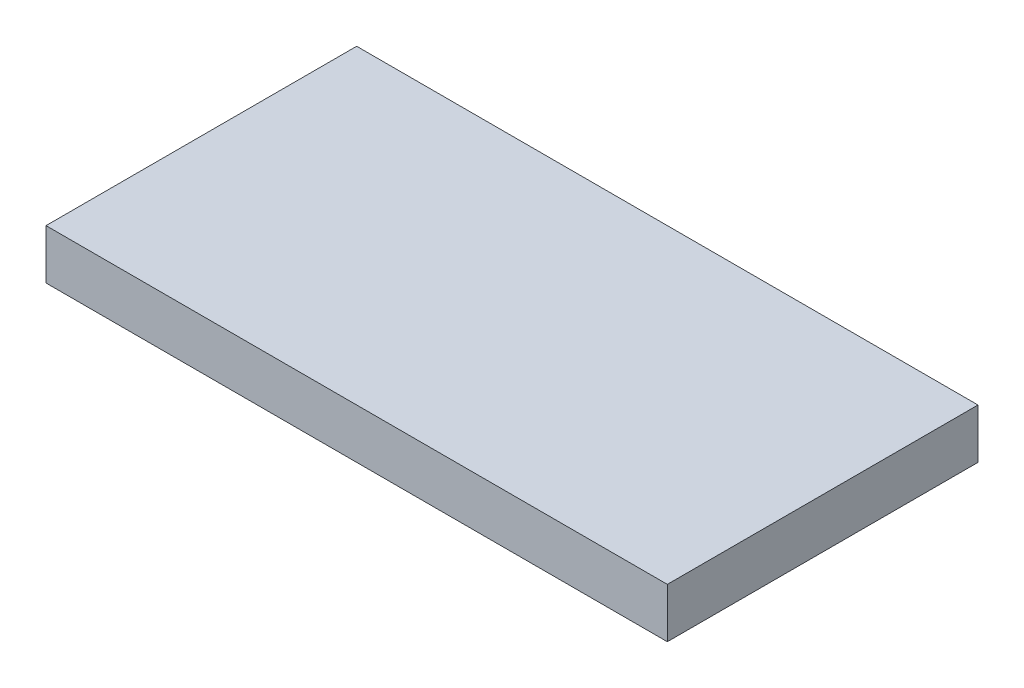
ISO-10303-21;
HEADER;
FILE_DESCRIPTION(('STEP AP214'),'2;1');
FILE_NAME('part.step','',(''),(''),'','','');
FILE_SCHEMA(('AUTOMOTIVE_DESIGN { 1 0 10303 214 1 1 1 1 }'));
ENDSEC;
DATA;
#1=APPLICATION_CONTEXT('core data for automotive mechanical design processes');
#2=APPLICATION_PROTOCOL_DEFINITION('international standard','automotive_design',2000,#1);
#3=PRODUCT_CONTEXT('',#1,'mechanical');
#4=PRODUCT('Part','Part','',(#3));
#5=PRODUCT_RELATED_PRODUCT_CATEGORY('part','',(#4));
#6=PRODUCT_DEFINITION_FORMATION('','',#4);
#7=PRODUCT_DEFINITION_CONTEXT('part definition',#1,'design');
#8=PRODUCT_DEFINITION('design','',#6,#7);
#9=PRODUCT_DEFINITION_SHAPE('','',#8);
#10=(LENGTH_UNIT() NAMED_UNIT(*) SI_UNIT(.MILLI.,.METRE.));
#11=(NAMED_UNIT(*) PLANE_ANGLE_UNIT() SI_UNIT($,.RADIAN.));
#12=(NAMED_UNIT(*) SI_UNIT($,.STERADIAN.) SOLID_ANGLE_UNIT());
#13=UNCERTAINTY_MEASURE_WITH_UNIT(LENGTH_MEASURE(1.E-05),#10,'distance_accuracy_value','');
#14=(GEOMETRIC_REPRESENTATION_CONTEXT(3) GLOBAL_UNCERTAINTY_ASSIGNED_CONTEXT((#13)) GLOBAL_UNIT_ASSIGNED_CONTEXT((#10,
#11,#12)) REPRESENTATION_CONTEXT('',''));
#15=CARTESIAN_POINT('',(0.,0.,0.));
#16=DIRECTION('',(0.,0.,1.));
#17=DIRECTION('',(1.,0.,0.));
#18=AXIS2_PLACEMENT_3D('',#15,#16,#17);
#19=CARTESIAN_POINT('',(0.,2.032,0.));
#20=DIRECTION('',(-1.,0.,0.));
#21=DIRECTION('',(0.,0.,1.));
#22=AXIS2_PLACEMENT_3D('',#19,#20,#21);
#23=PLANE('',#22);
#24=DIRECTION('',(0.,0.,-1.));
#25=VECTOR('',#24,1.);
#26=CARTESIAN_POINT('',(0.,0.,0.));
#27=LINE('',#26,#25);
#28=CARTESIAN_POINT('',(0.,0.,0.));
#29=VERTEX_POINT('',#28);
#30=CARTESIAN_POINT('',(0.,0.,-12.7));
#31=VERTEX_POINT('',#30);
#32=EDGE_CURVE('E107',#29,#31,#27,.T.);
#33=ORIENTED_EDGE('',*,*,#32,.T.);
#34=DIRECTION('',(0.,-1.,0.));
#35=VECTOR('',#34,1.);
#36=CARTESIAN_POINT('',(0.,2.032,-12.7));
#37=LINE('',#36,#35);
#38=CARTESIAN_POINT('',(0.,2.032,-12.7));
#39=VERTEX_POINT('',#38);
#40=EDGE_CURVE('E11',#39,#31,#37,.T.);
#41=ORIENTED_EDGE('',*,*,#40,.F.);
#42=DIRECTION('',(0.,0.,-1.));
#43=VECTOR('',#42,1.);
#44=CARTESIAN_POINT('',(0.,2.032,0.));
#45=LINE('',#44,#43);
#46=CARTESIAN_POINT('',(0.,2.032,0.));
#47=VERTEX_POINT('',#46);
#48=EDGE_CURVE('E91',#47,#39,#45,.T.);
#49=ORIENTED_EDGE('',*,*,#48,.F.);
#50=DIRECTION('',(0.,-1.,0.));
#51=VECTOR('',#50,1.);
#52=CARTESIAN_POINT('',(0.,2.032,0.));
#53=LINE('',#52,#51);
#54=EDGE_CURVE('E103',#47,#29,#53,.T.);
#55=ORIENTED_EDGE('',*,*,#54,.T.);
#56=EDGE_LOOP('',(#33,#41,#49,#55));
#57=FACE_BOUND('',#56,.T.);
#58=ADVANCED_FACE('F39',(#57),#23,.F.);
#59=CARTESIAN_POINT('',(0.,2.032,-12.7));
#60=DIRECTION('',(0.,0.,1.));
#61=DIRECTION('',(1.,0.,0.));
#62=AXIS2_PLACEMENT_3D('',#59,#60,#61);
#63=PLANE('',#62);
#64=DIRECTION('',(-1.,0.,0.));
#65=VECTOR('',#64,1.);
#66=CARTESIAN_POINT('',(0.,0.,-12.7));
#67=LINE('',#66,#65);
#68=CARTESIAN_POINT('',(-25.4,0.,-12.7));
#69=VERTEX_POINT('',#68);
#70=EDGE_CURVE('E96',#31,#69,#67,.T.);
#71=ORIENTED_EDGE('',*,*,#70,.T.);
#72=DIRECTION('',(0.,-1.,0.));
#73=VECTOR('',#72,1.);
#74=CARTESIAN_POINT('',(-25.4,2.032,-12.7));
#75=LINE('',#74,#73);
#76=CARTESIAN_POINT('',(-25.4,2.032,-12.7));
#77=VERTEX_POINT('',#76);
#78=EDGE_CURVE('E48',#77,#69,#75,.T.);
#79=ORIENTED_EDGE('',*,*,#78,.F.);
#80=DIRECTION('',(-1.,0.,0.));
#81=VECTOR('',#80,1.);
#82=CARTESIAN_POINT('',(0.,2.032,-12.7));
#83=LINE('',#82,#81);
#84=EDGE_CURVE('E86',#39,#77,#83,.T.);
#85=ORIENTED_EDGE('',*,*,#84,.F.);
#86=ORIENTED_EDGE('',*,*,#40,.T.);
#87=EDGE_LOOP('',(#71,#79,#85,#86));
#88=FACE_BOUND('',#87,.T.);
#89=ADVANCED_FACE('F95',(#88),#63,.F.);
#90=CARTESIAN_POINT('',(-25.4,2.032,0.));
#91=DIRECTION('',(1.,0.,0.));
#92=DIRECTION('',(0.,0.,-1.));
#93=AXIS2_PLACEMENT_3D('',#90,#91,#92);
#94=PLANE('',#93);
#95=DIRECTION('',(0.,0.,1.));
#96=VECTOR('',#95,1.);
#97=CARTESIAN_POINT('',(-25.4,0.,0.));
#98=LINE('',#97,#96);
#99=CARTESIAN_POINT('',(-25.4,0.,0.));
#100=VERTEX_POINT('',#99);
#101=EDGE_CURVE('E73',#69,#100,#98,.T.);
#102=ORIENTED_EDGE('',*,*,#101,.T.);
#103=DIRECTION('',(0.,-1.,0.));
#104=VECTOR('',#103,1.);
#105=CARTESIAN_POINT('',(-25.4,2.032,0.));
#106=LINE('',#105,#104);
#107=CARTESIAN_POINT('',(-25.4,2.032,0.));
#108=VERTEX_POINT('',#107);
#109=EDGE_CURVE('E98',#108,#100,#106,.T.);
#110=ORIENTED_EDGE('',*,*,#109,.F.);
#111=DIRECTION('',(0.,0.,1.));
#112=VECTOR('',#111,1.);
#113=CARTESIAN_POINT('',(-25.4,2.032,0.));
#114=LINE('',#113,#112);
#115=EDGE_CURVE('E89',#77,#108,#114,.T.);
#116=ORIENTED_EDGE('',*,*,#115,.F.);
#117=ORIENTED_EDGE('',*,*,#78,.T.);
#118=EDGE_LOOP('',(#102,#110,#116,#117));
#119=FACE_BOUND('',#118,.T.);
#120=ADVANCED_FACE('F99',(#119),#94,.F.);
#121=CARTESIAN_POINT('',(0.,2.032,0.));
#122=DIRECTION('',(0.,0.,-1.));
#123=DIRECTION('',(-1.,0.,0.));
#124=AXIS2_PLACEMENT_3D('',#121,#122,#123);
#125=PLANE('',#124);
#126=DIRECTION('',(1.,0.,0.));
#127=VECTOR('',#126,1.);
#128=CARTESIAN_POINT('',(0.,0.,0.));
#129=LINE('',#128,#127);
#130=EDGE_CURVE('E79',#100,#29,#129,.T.);
#131=ORIENTED_EDGE('',*,*,#130,.T.);
#132=ORIENTED_EDGE('',*,*,#54,.F.);
#133=DIRECTION('',(1.,0.,0.));
#134=VECTOR('',#133,1.);
#135=CARTESIAN_POINT('',(0.,2.032,0.));
#136=LINE('',#135,#134);
#137=EDGE_CURVE('E56',#108,#47,#136,.T.);
#138=ORIENTED_EDGE('',*,*,#137,.F.);
#139=ORIENTED_EDGE('',*,*,#109,.T.);
#140=EDGE_LOOP('',(#131,#132,#138,#139));
#141=FACE_BOUND('',#140,.T.);
#142=ADVANCED_FACE('F120',(#141),#125,.F.);
#143=CARTESIAN_POINT('',(0.,2.032,0.));
#144=DIRECTION('',(0.,1.,0.));
#145=DIRECTION('',(0.,0.,1.));
#146=AXIS2_PLACEMENT_3D('',#143,#144,#145);
#147=PLANE('',#146);
#148=ORIENTED_EDGE('',*,*,#48,.T.);
#149=ORIENTED_EDGE('',*,*,#84,.T.);
#150=ORIENTED_EDGE('',*,*,#115,.T.);
#151=ORIENTED_EDGE('',*,*,#137,.T.);
#152=EDGE_LOOP('',(#148,#149,#150,#151));
#153=FACE_BOUND('',#152,.T.);
#154=ADVANCED_FACE('F87',(#153),#147,.T.);
#155=CARTESIAN_POINT('',(0.,0.,0.));
#156=DIRECTION('',(0.,1.,0.));
#157=DIRECTION('',(0.,0.,1.));
#158=AXIS2_PLACEMENT_3D('',#155,#156,#157);
#159=PLANE('',#158);
#160=ORIENTED_EDGE('',*,*,#32,.F.);
#161=ORIENTED_EDGE('',*,*,#130,.F.);
#162=ORIENTED_EDGE('',*,*,#101,.F.);
#163=ORIENTED_EDGE('',*,*,#70,.F.);
#164=EDGE_LOOP('',(#160,#161,#162,#163));
#165=FACE_BOUND('',#164,.T.);
#166=ADVANCED_FACE('F123',(#165),#159,.F.);
#167=CLOSED_SHELL('',(#58,#89,#120,#142,#154,#166));
#168=MANIFOLD_SOLID_BREP('B2',#167);
#169=ADVANCED_BREP_SHAPE_REPRESENTATION('',(#18,#168),#14);
#170=SHAPE_DEFINITION_REPRESENTATION(#9,#169);
ENDSEC;
END-ISO-10303-21;
